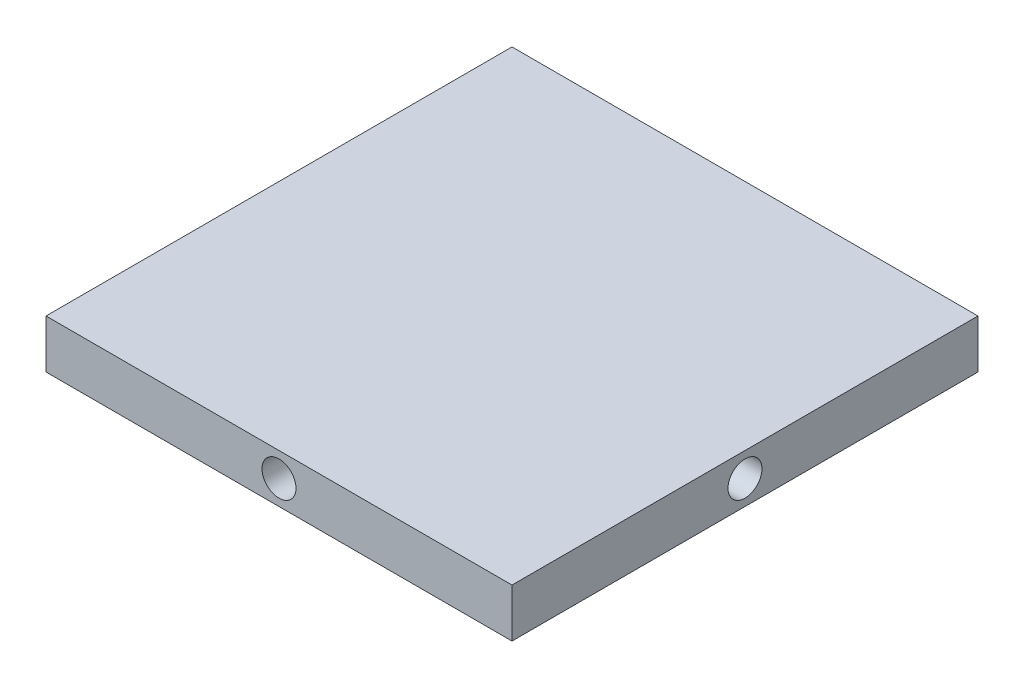
ISO-10303-21;
HEADER;
FILE_DESCRIPTION(('STEP AP214'),'2;1');
FILE_NAME('part.step','',(''),(''),'','','');
FILE_SCHEMA(('AUTOMOTIVE_DESIGN { 1 0 10303 214 1 1 1 1 }'));
ENDSEC;
DATA;
#1=APPLICATION_CONTEXT('core data for automotive mechanical design processes');
#2=APPLICATION_PROTOCOL_DEFINITION('international standard','automotive_design',2000,#1);
#3=PRODUCT_CONTEXT('',#1,'mechanical');
#4=PRODUCT('Part','Part','',(#3));
#5=PRODUCT_RELATED_PRODUCT_CATEGORY('part','',(#4));
#6=PRODUCT_DEFINITION_FORMATION('','',#4);
#7=PRODUCT_DEFINITION_CONTEXT('part definition',#1,'design');
#8=PRODUCT_DEFINITION('design','',#6,#7);
#9=PRODUCT_DEFINITION_SHAPE('','',#8);
#10=(LENGTH_UNIT() NAMED_UNIT(*) SI_UNIT(.MILLI.,.METRE.));
#11=(NAMED_UNIT(*) PLANE_ANGLE_UNIT() SI_UNIT($,.RADIAN.));
#12=(NAMED_UNIT(*) SI_UNIT($,.STERADIAN.) SOLID_ANGLE_UNIT());
#13=UNCERTAINTY_MEASURE_WITH_UNIT(LENGTH_MEASURE(1.E-05),#10,'distance_accuracy_value','');
#14=(GEOMETRIC_REPRESENTATION_CONTEXT(3) GLOBAL_UNCERTAINTY_ASSIGNED_CONTEXT((#13)) GLOBAL_UNIT_ASSIGNED_CONTEXT((#10,
#11,#12)) REPRESENTATION_CONTEXT('',''));
#15=CARTESIAN_POINT('',(0.,0.,0.));
#16=DIRECTION('',(0.,0.,1.));
#17=DIRECTION('',(1.,0.,0.));
#18=AXIS2_PLACEMENT_3D('',#15,#16,#17);
#19=CARTESIAN_POINT('',(48.,10.,48.));
#20=DIRECTION('',(-1.,0.,0.));
#21=DIRECTION('',(0.,0.,1.));
#22=AXIS2_PLACEMENT_3D('',#19,#20,#21);
#23=PLANE('',#22);
#24=CARTESIAN_POINT('',(48.,5.,0.));
#25=DIRECTION('',(1.,0.,0.));
#26=DIRECTION('',(0.,0.,-1.));
#27=AXIS2_PLACEMENT_3D('',#24,#25,#26);
#28=CIRCLE('',#27,3.5);
#29=CARTESIAN_POINT('',(48.,5.,-3.49999999999997));
#30=VERTEX_POINT('',#29);
#31=EDGE_CURVE('E136',#30,#30,#28,.T.);
#32=ORIENTED_EDGE('',*,*,#31,.F.);
#33=EDGE_LOOP('',(#32));
#34=FACE_BOUND('',#33,.T.);
#35=DIRECTION('',(0.,0.,-1.));
#36=VECTOR('',#35,1.);
#37=CARTESIAN_POINT('',(48.,0.,48.));
#38=LINE('',#37,#36);
#39=CARTESIAN_POINT('',(48.,0.,48.));
#40=VERTEX_POINT('',#39);
#41=CARTESIAN_POINT('',(48.,0.,-48.));
#42=VERTEX_POINT('',#41);
#43=EDGE_CURVE('E107',#40,#42,#38,.T.);
#44=ORIENTED_EDGE('',*,*,#43,.T.);
#45=DIRECTION('',(0.,-1.,0.));
#46=VECTOR('',#45,1.);
#47=CARTESIAN_POINT('',(48.,10.,-48.));
#48=LINE('',#47,#46);
#49=CARTESIAN_POINT('',(48.,10.,-48.));
#50=VERTEX_POINT('',#49);
#51=EDGE_CURVE('E11',#50,#42,#48,.T.);
#52=ORIENTED_EDGE('',*,*,#51,.F.);
#53=DIRECTION('',(0.,0.,-1.));
#54=VECTOR('',#53,1.);
#55=CARTESIAN_POINT('',(48.,10.,48.));
#56=LINE('',#55,#54);
#57=CARTESIAN_POINT('',(48.,10.,48.));
#58=VERTEX_POINT('',#57);
#59=EDGE_CURVE('E91',#58,#50,#56,.T.);
#60=ORIENTED_EDGE('',*,*,#59,.F.);
#61=DIRECTION('',(0.,-1.,0.));
#62=VECTOR('',#61,1.);
#63=CARTESIAN_POINT('',(48.,10.,48.));
#64=LINE('',#63,#62);
#65=EDGE_CURVE('E103',#58,#40,#64,.T.);
#66=ORIENTED_EDGE('',*,*,#65,.T.);
#67=EDGE_LOOP('',(#44,#52,#60,#66));
#68=FACE_BOUND('',#67,.T.);
#69=ADVANCED_FACE('F39',(#34,#68),#23,.F.);
#70=CARTESIAN_POINT('',(-48.,10.,-48.));
#71=DIRECTION('',(0.,0.,1.));
#72=DIRECTION('',(1.,0.,0.));
#73=AXIS2_PLACEMENT_3D('',#70,#71,#72);
#74=PLANE('',#73);
#75=CARTESIAN_POINT('',(0.,5.,-48.));
#76=DIRECTION('',(0.,0.,-1.));
#77=DIRECTION('',(-1.,0.,0.));
#78=AXIS2_PLACEMENT_3D('',#75,#76,#77);
#79=CIRCLE('',#78,3.5);
#80=CARTESIAN_POINT('',(-3.5,5.,-48.));
#81=VERTEX_POINT('',#80);
#82=EDGE_CURVE('E144',#81,#81,#79,.T.);
#83=ORIENTED_EDGE('',*,*,#82,.F.);
#84=EDGE_LOOP('',(#83));
#85=FACE_BOUND('',#84,.T.);
#86=DIRECTION('',(-1.,0.,0.));
#87=VECTOR('',#86,1.);
#88=CARTESIAN_POINT('',(-48.,0.,-48.));
#89=LINE('',#88,#87);
#90=CARTESIAN_POINT('',(-48.,0.,-48.));
#91=VERTEX_POINT('',#90);
#92=EDGE_CURVE('E96',#42,#91,#89,.T.);
#93=ORIENTED_EDGE('',*,*,#92,.T.);
#94=DIRECTION('',(0.,-1.,0.));
#95=VECTOR('',#94,1.);
#96=CARTESIAN_POINT('',(-48.,10.,-48.));
#97=LINE('',#96,#95);
#98=CARTESIAN_POINT('',(-48.,10.,-48.));
#99=VERTEX_POINT('',#98);
#100=EDGE_CURVE('E48',#99,#91,#97,.T.);
#101=ORIENTED_EDGE('',*,*,#100,.F.);
#102=DIRECTION('',(-1.,0.,0.));
#103=VECTOR('',#102,1.);
#104=CARTESIAN_POINT('',(-48.,10.,-48.));
#105=LINE('',#104,#103);
#106=EDGE_CURVE('E86',#50,#99,#105,.T.);
#107=ORIENTED_EDGE('',*,*,#106,.F.);
#108=ORIENTED_EDGE('',*,*,#51,.T.);
#109=EDGE_LOOP('',(#93,#101,#107,#108));
#110=FACE_BOUND('',#109,.T.);
#111=ADVANCED_FACE('F95',(#85,#110),#74,.F.);
#112=CARTESIAN_POINT('',(-48.,10.,48.));
#113=DIRECTION('',(1.,0.,0.));
#114=DIRECTION('',(0.,0.,-1.));
#115=AXIS2_PLACEMENT_3D('',#112,#113,#114);
#116=PLANE('',#115);
#117=CARTESIAN_POINT('',(-48.,5.,0.));
#118=DIRECTION('',(-1.,0.,0.));
#119=DIRECTION('',(0.,0.,1.));
#120=AXIS2_PLACEMENT_3D('',#117,#118,#119);
#121=CIRCLE('',#120,3.5);
#122=CARTESIAN_POINT('',(-48.,5.,3.49999999999997));
#123=VERTEX_POINT('',#122);
#124=EDGE_CURVE('E152',#123,#123,#121,.T.);
#125=ORIENTED_EDGE('',*,*,#124,.F.);
#126=EDGE_LOOP('',(#125));
#127=FACE_BOUND('',#126,.T.);
#128=DIRECTION('',(0.,0.,1.));
#129=VECTOR('',#128,1.);
#130=CARTESIAN_POINT('',(-48.,0.,48.));
#131=LINE('',#130,#129);
#132=CARTESIAN_POINT('',(-48.,0.,48.));
#133=VERTEX_POINT('',#132);
#134=EDGE_CURVE('E73',#91,#133,#131,.T.);
#135=ORIENTED_EDGE('',*,*,#134,.T.);
#136=DIRECTION('',(0.,-1.,0.));
#137=VECTOR('',#136,1.);
#138=CARTESIAN_POINT('',(-48.,10.,48.));
#139=LINE('',#138,#137);
#140=CARTESIAN_POINT('',(-48.,10.,48.));
#141=VERTEX_POINT('',#140);
#142=EDGE_CURVE('E98',#141,#133,#139,.T.);
#143=ORIENTED_EDGE('',*,*,#142,.F.);
#144=DIRECTION('',(0.,0.,1.));
#145=VECTOR('',#144,1.);
#146=CARTESIAN_POINT('',(-48.,10.,48.));
#147=LINE('',#146,#145);
#148=EDGE_CURVE('E89',#99,#141,#147,.T.);
#149=ORIENTED_EDGE('',*,*,#148,.F.);
#150=ORIENTED_EDGE('',*,*,#100,.T.);
#151=EDGE_LOOP('',(#135,#143,#149,#150));
#152=FACE_BOUND('',#151,.T.);
#153=ADVANCED_FACE('F99',(#127,#152),#116,.F.);
#154=CARTESIAN_POINT('',(-48.,10.,48.));
#155=DIRECTION('',(0.,0.,-1.));
#156=DIRECTION('',(-1.,0.,0.));
#157=AXIS2_PLACEMENT_3D('',#154,#155,#156);
#158=PLANE('',#157);
#159=CARTESIAN_POINT('',(0.,5.,48.));
#160=DIRECTION('',(0.,0.,1.));
#161=DIRECTION('',(1.,0.,0.));
#162=AXIS2_PLACEMENT_3D('',#159,#160,#161);
#163=CIRCLE('',#162,3.5);
#164=CARTESIAN_POINT('',(3.50000000000003,5.,48.));
#165=VERTEX_POINT('',#164);
#166=EDGE_CURVE('E128',#165,#165,#163,.T.);
#167=ORIENTED_EDGE('',*,*,#166,.F.);
#168=EDGE_LOOP('',(#167));
#169=FACE_BOUND('',#168,.T.);
#170=DIRECTION('',(1.,0.,0.));
#171=VECTOR('',#170,1.);
#172=CARTESIAN_POINT('',(-48.,0.,48.));
#173=LINE('',#172,#171);
#174=EDGE_CURVE('E79',#133,#40,#173,.T.);
#175=ORIENTED_EDGE('',*,*,#174,.T.);
#176=ORIENTED_EDGE('',*,*,#65,.F.);
#177=DIRECTION('',(1.,0.,0.));
#178=VECTOR('',#177,1.);
#179=CARTESIAN_POINT('',(-48.,10.,48.));
#180=LINE('',#179,#178);
#181=EDGE_CURVE('E56',#141,#58,#180,.T.);
#182=ORIENTED_EDGE('',*,*,#181,.F.);
#183=ORIENTED_EDGE('',*,*,#142,.T.);
#184=EDGE_LOOP('',(#175,#176,#182,#183));
#185=FACE_BOUND('',#184,.T.);
#186=ADVANCED_FACE('F121',(#169,#185),#158,.F.);
#187=CARTESIAN_POINT('',(0.,10.,0.));
#188=DIRECTION('',(0.,-1.,0.));
#189=DIRECTION('',(0.,0.,-1.));
#190=AXIS2_PLACEMENT_3D('',#187,#188,#189);
#191=PLANE('',#190);
#192=ORIENTED_EDGE('',*,*,#59,.T.);
#193=ORIENTED_EDGE('',*,*,#106,.T.);
#194=ORIENTED_EDGE('',*,*,#148,.T.);
#195=ORIENTED_EDGE('',*,*,#181,.T.);
#196=EDGE_LOOP('',(#192,#193,#194,#195));
#197=FACE_BOUND('',#196,.T.);
#198=ADVANCED_FACE('F87',(#197),#191,.F.);
#199=CARTESIAN_POINT('',(0.,0.,0.));
#200=DIRECTION('',(0.,-1.,0.));
#201=DIRECTION('',(0.,0.,-1.));
#202=AXIS2_PLACEMENT_3D('',#199,#200,#201);
#203=PLANE('',#202);
#204=ORIENTED_EDGE('',*,*,#43,.F.);
#205=ORIENTED_EDGE('',*,*,#174,.F.);
#206=ORIENTED_EDGE('',*,*,#134,.F.);
#207=ORIENTED_EDGE('',*,*,#92,.F.);
#208=EDGE_LOOP('',(#204,#205,#206,#207));
#209=FACE_BOUND('',#208,.T.);
#210=ADVANCED_FACE('F124',(#209),#203,.T.);
#211=CARTESIAN_POINT('',(0.,5.,38.));
#212=DIRECTION('',(0.,0.,1.));
#213=DIRECTION('',(1.,0.,0.));
#214=AXIS2_PLACEMENT_3D('',#211,#212,#213);
#215=CYLINDRICAL_SURFACE('',#214,3.5);
#216=CARTESIAN_POINT('',(0.,5.,38.));
#217=DIRECTION('',(0.,0.,1.));
#218=DIRECTION('',(1.,0.,0.));
#219=AXIS2_PLACEMENT_3D('',#216,#217,#218);
#220=CIRCLE('',#219,3.5);
#221=CARTESIAN_POINT('',(3.50000000000003,5.,38.));
#222=VERTEX_POINT('',#221);
#223=EDGE_CURVE('E111',#222,#222,#220,.T.);
#224=ORIENTED_EDGE('',*,*,#223,.F.);
#225=EDGE_LOOP('',(#224));
#226=FACE_BOUND('',#225,.T.);
#227=ORIENTED_EDGE('',*,*,#166,.T.);
#228=EDGE_LOOP('',(#227));
#229=FACE_BOUND('',#228,.T.);
#230=ADVANCED_FACE('F197',(#226,#229),#215,.F.);
#231=CARTESIAN_POINT('',(0.,5.,38.));
#232=DIRECTION('',(0.,0.,1.));
#233=DIRECTION('',(1.,0.,0.));
#234=AXIS2_PLACEMENT_3D('',#231,#232,#233);
#235=PLANE('',#234);
#236=ORIENTED_EDGE('',*,*,#223,.T.);
#237=EDGE_LOOP('',(#236));
#238=FACE_BOUND('',#237,.T.);
#239=ADVANCED_FACE('F187',(#238),#235,.T.);
#240=CARTESIAN_POINT('',(38.,5.,0.));
#241=DIRECTION('',(1.,0.,0.));
#242=DIRECTION('',(0.,0.,-1.));
#243=AXIS2_PLACEMENT_3D('',#240,#241,#242);
#244=CYLINDRICAL_SURFACE('',#243,3.5);
#245=CARTESIAN_POINT('',(38.,5.,0.));
#246=DIRECTION('',(1.,0.,0.));
#247=DIRECTION('',(0.,0.,-1.));
#248=AXIS2_PLACEMENT_3D('',#245,#246,#247);
#249=CIRCLE('',#248,3.5);
#250=CARTESIAN_POINT('',(38.,5.,-3.49999999999997));
#251=VERTEX_POINT('',#250);
#252=EDGE_CURVE('E132',#251,#251,#249,.T.);
#253=ORIENTED_EDGE('',*,*,#252,.F.);
#254=EDGE_LOOP('',(#253));
#255=FACE_BOUND('',#254,.T.);
#256=ORIENTED_EDGE('',*,*,#31,.T.);
#257=EDGE_LOOP('',(#256));
#258=FACE_BOUND('',#257,.T.);
#259=ADVANCED_FACE('F184',(#255,#258),#244,.F.);
#260=CARTESIAN_POINT('',(38.,5.,0.));
#261=DIRECTION('',(1.,0.,0.));
#262=DIRECTION('',(0.,0.,-1.));
#263=AXIS2_PLACEMENT_3D('',#260,#261,#262);
#264=PLANE('',#263);
#265=ORIENTED_EDGE('',*,*,#252,.T.);
#266=EDGE_LOOP('',(#265));
#267=FACE_BOUND('',#266,.T.);
#268=ADVANCED_FACE('F186',(#267),#264,.T.);
#269=CARTESIAN_POINT('',(0.,5.,-38.));
#270=DIRECTION('',(0.,0.,-1.));
#271=DIRECTION('',(-1.,0.,0.));
#272=AXIS2_PLACEMENT_3D('',#269,#270,#271);
#273=CYLINDRICAL_SURFACE('',#272,3.5);
#274=CARTESIAN_POINT('',(0.,5.,-38.));
#275=DIRECTION('',(0.,0.,-1.));
#276=DIRECTION('',(-1.,0.,0.));
#277=AXIS2_PLACEMENT_3D('',#274,#275,#276);
#278=CIRCLE('',#277,3.5);
#279=CARTESIAN_POINT('',(-3.5,5.,-38.));
#280=VERTEX_POINT('',#279);
#281=EDGE_CURVE('E140',#280,#280,#278,.T.);
#282=ORIENTED_EDGE('',*,*,#281,.F.);
#283=EDGE_LOOP('',(#282));
#284=FACE_BOUND('',#283,.T.);
#285=ORIENTED_EDGE('',*,*,#82,.T.);
#286=EDGE_LOOP('',(#285));
#287=FACE_BOUND('',#286,.T.);
#288=ADVANCED_FACE('F194',(#284,#287),#273,.F.);
#289=CARTESIAN_POINT('',(0.,0.,-38.));
#290=DIRECTION('',(0.,0.,-1.));
#291=DIRECTION('',(-1.,0.,0.));
#292=AXIS2_PLACEMENT_3D('',#289,#290,#291);
#293=PLANE('',#292);
#294=ORIENTED_EDGE('',*,*,#281,.T.);
#295=EDGE_LOOP('',(#294));
#296=FACE_BOUND('',#295,.T.);
#297=ADVANCED_FACE('F165',(#296),#293,.T.);
#298=CARTESIAN_POINT('',(-38.,5.,0.));
#299=DIRECTION('',(-1.,0.,0.));
#300=DIRECTION('',(0.,0.,1.));
#301=AXIS2_PLACEMENT_3D('',#298,#299,#300);
#302=CYLINDRICAL_SURFACE('',#301,3.5);
#303=CARTESIAN_POINT('',(-38.,5.,0.));
#304=DIRECTION('',(-1.,0.,0.));
#305=DIRECTION('',(0.,0.,1.));
#306=AXIS2_PLACEMENT_3D('',#303,#304,#305);
#307=CIRCLE('',#306,3.5);
#308=CARTESIAN_POINT('',(-38.,5.,3.49999999999997));
#309=VERTEX_POINT('',#308);
#310=EDGE_CURVE('E148',#309,#309,#307,.T.);
#311=ORIENTED_EDGE('',*,*,#310,.F.);
#312=EDGE_LOOP('',(#311));
#313=FACE_BOUND('',#312,.T.);
#314=ORIENTED_EDGE('',*,*,#124,.T.);
#315=EDGE_LOOP('',(#314));
#316=FACE_BOUND('',#315,.T.);
#317=ADVANCED_FACE('F162',(#313,#316),#302,.F.);
#318=CARTESIAN_POINT('',(-38.,5.,0.));
#319=DIRECTION('',(-1.,0.,0.));
#320=DIRECTION('',(0.,0.,1.));
#321=AXIS2_PLACEMENT_3D('',#318,#319,#320);
#322=PLANE('',#321);
#323=ORIENTED_EDGE('',*,*,#310,.T.);
#324=EDGE_LOOP('',(#323));
#325=FACE_BOUND('',#324,.T.);
#326=ADVANCED_FACE('F160',(#325),#322,.T.);
#327=CLOSED_SHELL('',(#69,#111,#153,#186,#198,#210,#230,#239,#259,#268,#288,#297,#317,#326));
#328=MANIFOLD_SOLID_BREP('B2',#327);
#329=ADVANCED_BREP_SHAPE_REPRESENTATION('',(#18,#328),#14);
#330=SHAPE_DEFINITION_REPRESENTATION(#9,#329);
ENDSEC;
END-ISO-10303-21;
